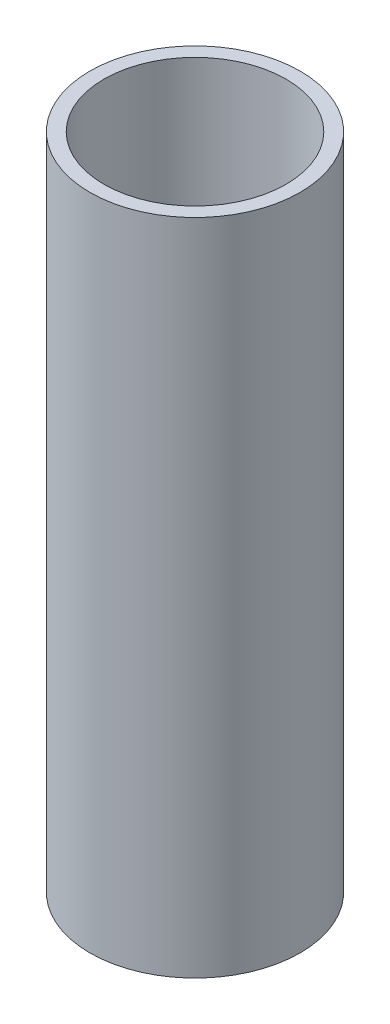
ISO-10303-21;
HEADER;
FILE_DESCRIPTION(('STEP AP214'),'2;1');
FILE_NAME('part.step','',(''),(''),'','','');
FILE_SCHEMA(('AUTOMOTIVE_DESIGN { 1 0 10303 214 1 1 1 1 }'));
ENDSEC;
DATA;
#1=APPLICATION_CONTEXT('core data for automotive mechanical design processes');
#2=APPLICATION_PROTOCOL_DEFINITION('international standard','automotive_design',2000,#1);
#3=PRODUCT_CONTEXT('',#1,'mechanical');
#4=PRODUCT('Part','Part','',(#3));
#5=PRODUCT_RELATED_PRODUCT_CATEGORY('part','',(#4));
#6=PRODUCT_DEFINITION_FORMATION('','',#4);
#7=PRODUCT_DEFINITION_CONTEXT('part definition',#1,'design');
#8=PRODUCT_DEFINITION('design','',#6,#7);
#9=PRODUCT_DEFINITION_SHAPE('','',#8);
#10=(LENGTH_UNIT() NAMED_UNIT(*) SI_UNIT(.MILLI.,.METRE.));
#11=(NAMED_UNIT(*) PLANE_ANGLE_UNIT() SI_UNIT($,.RADIAN.));
#12=(NAMED_UNIT(*) SI_UNIT($,.STERADIAN.) SOLID_ANGLE_UNIT());
#13=UNCERTAINTY_MEASURE_WITH_UNIT(LENGTH_MEASURE(1.E-05),#10,'distance_accuracy_value','');
#14=(GEOMETRIC_REPRESENTATION_CONTEXT(3) GLOBAL_UNCERTAINTY_ASSIGNED_CONTEXT((#13)) GLOBAL_UNIT_ASSIGNED_CONTEXT((#10,
#11,#12)) REPRESENTATION_CONTEXT('',''));
#15=CARTESIAN_POINT('',(0.,0.,0.));
#16=DIRECTION('',(0.,0.,1.));
#17=DIRECTION('',(1.,0.,0.));
#18=AXIS2_PLACEMENT_3D('',#15,#16,#17);
#19=CARTESIAN_POINT('',(13.,0.,0.));
#20=DIRECTION('',(0.,-1.,0.));
#21=DIRECTION('',(1.,0.,0.));
#22=AXIS2_PLACEMENT_3D('',#19,#20,#21);
#23=PLANE('',#22);
#24=CARTESIAN_POINT('',(0.,0.,0.));
#25=DIRECTION('',(0.,1.,0.));
#26=DIRECTION('',(-1.,0.,0.));
#27=AXIS2_PLACEMENT_3D('',#24,#25,#26);
#28=CIRCLE('',#27,13.);
#29=CARTESIAN_POINT('',(-13.,0.,0.));
#30=VERTEX_POINT('',#29);
#31=EDGE_CURVE('E54',#30,#30,#28,.T.);
#32=ORIENTED_EDGE('',*,*,#31,.F.);
#33=EDGE_LOOP('',(#32));
#34=FACE_BOUND('',#33,.T.);
#35=CARTESIAN_POINT('',(0.,0.,0.));
#36=DIRECTION('',(0.,1.,0.));
#37=DIRECTION('',(-1.,0.,0.));
#38=AXIS2_PLACEMENT_3D('',#35,#36,#37);
#39=CIRCLE('',#38,15.);
#40=CARTESIAN_POINT('',(-15.,-1.02907469966573E-13,0.));
#41=VERTEX_POINT('',#40);
#42=EDGE_CURVE('E10',#41,#41,#39,.T.);
#43=ORIENTED_EDGE('',*,*,#42,.T.);
#44=EDGE_LOOP('',(#43));
#45=FACE_BOUND('',#44,.T.);
#46=ADVANCED_FACE('F37',(#34,#45),#23,.F.);
#47=CARTESIAN_POINT('',(0.,0.,0.));
#48=DIRECTION('',(0.,1.,0.));
#49=DIRECTION('',(-1.,0.,0.));
#50=AXIS2_PLACEMENT_3D('',#47,#48,#49);
#51=CYLINDRICAL_SURFACE('',#50,14.9999999999998);
#52=ORIENTED_EDGE('',*,*,#42,.F.);
#53=EDGE_LOOP('',(#52));
#54=FACE_BOUND('',#53,.T.);
#55=CARTESIAN_POINT('',(3.22443405895262E-13,-94.0000000000001,0.));
#56=DIRECTION('',(0.,1.,0.));
#57=DIRECTION('',(-1.,0.,0.));
#58=AXIS2_PLACEMENT_3D('',#55,#56,#57);
#59=CIRCLE('',#58,14.9999999999997);
#60=CARTESIAN_POINT('',(-14.9999999999994,-94.0000000000001,0.));
#61=VERTEX_POINT('',#60);
#62=EDGE_CURVE('E44',#61,#61,#59,.T.);
#63=ORIENTED_EDGE('',*,*,#62,.T.);
#64=EDGE_LOOP('',(#63));
#65=FACE_BOUND('',#64,.T.);
#66=ADVANCED_FACE('F64',(#54,#65),#51,.T.);
#67=CARTESIAN_POINT('',(13.,-94.,0.));
#68=DIRECTION('',(0.,1.,0.));
#69=DIRECTION('',(-1.,0.,0.));
#70=AXIS2_PLACEMENT_3D('',#67,#68,#69);
#71=PLANE('',#70);
#72=ORIENTED_EDGE('',*,*,#62,.F.);
#73=EDGE_LOOP('',(#72));
#74=FACE_BOUND('',#73,.T.);
#75=CARTESIAN_POINT('',(3.22443405895262E-13,-94.,0.));
#76=DIRECTION('',(0.,1.,0.));
#77=DIRECTION('',(-1.,0.,0.));
#78=AXIS2_PLACEMENT_3D('',#75,#76,#77);
#79=CIRCLE('',#78,12.9999999999997);
#80=CARTESIAN_POINT('',(-12.9999999999994,-94.0000000000001,0.));
#81=VERTEX_POINT('',#80);
#82=EDGE_CURVE('E49',#81,#81,#79,.T.);
#83=ORIENTED_EDGE('',*,*,#82,.T.);
#84=EDGE_LOOP('',(#83));
#85=FACE_BOUND('',#84,.T.);
#86=ADVANCED_FACE('F68',(#74,#85),#71,.F.);
#87=CARTESIAN_POINT('',(0.,0.,0.));
#88=DIRECTION('',(0.,1.,0.));
#89=DIRECTION('',(-1.,0.,0.));
#90=AXIS2_PLACEMENT_3D('',#87,#88,#89);
#91=CYLINDRICAL_SURFACE('',#90,12.9999999999998);
#92=ORIENTED_EDGE('',*,*,#82,.F.);
#93=EDGE_LOOP('',(#92));
#94=FACE_BOUND('',#93,.T.);
#95=ORIENTED_EDGE('',*,*,#31,.T.);
#96=EDGE_LOOP('',(#95));
#97=FACE_BOUND('',#96,.T.);
#98=ADVANCED_FACE('F61',(#94,#97),#91,.F.);
#99=CLOSED_SHELL('',(#46,#66,#86,#98));
#100=MANIFOLD_SOLID_BREP('B2',#99);
#101=ADVANCED_BREP_SHAPE_REPRESENTATION('',(#18,#100),#14);
#102=SHAPE_DEFINITION_REPRESENTATION(#9,#101);
ENDSEC;
END-ISO-10303-21;
